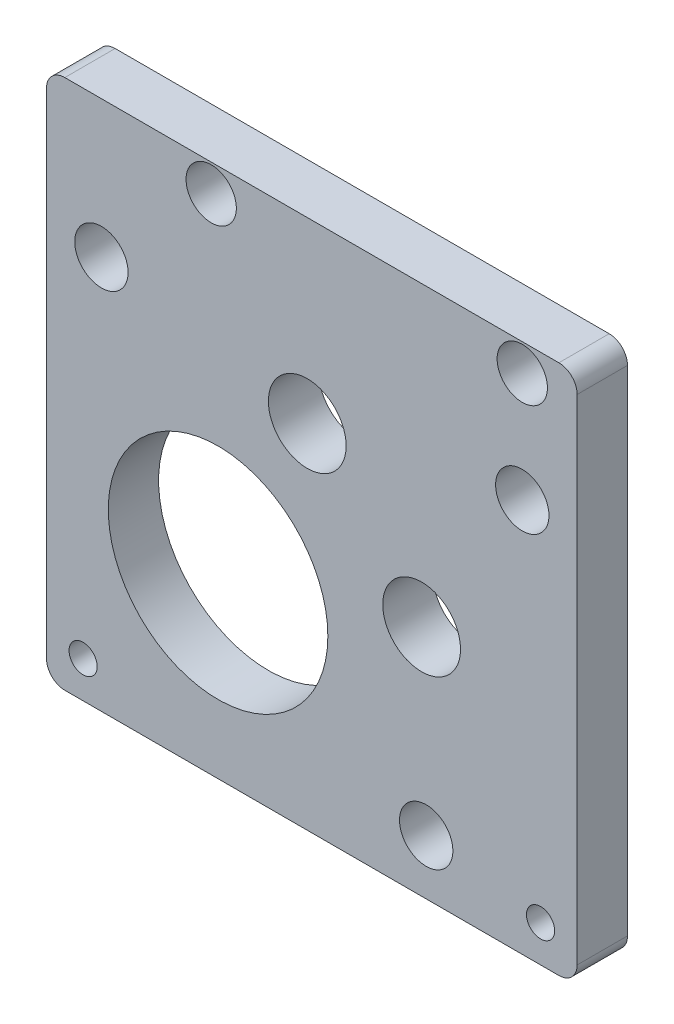
ISO-10303-21;
HEADER;
FILE_DESCRIPTION(('STEP AP214'),'2;1');
FILE_NAME('part.step','',(''),(''),'','','');
FILE_SCHEMA(('AUTOMOTIVE_DESIGN { 1 0 10303 214 1 1 1 1 }'));
ENDSEC;
DATA;
#1=APPLICATION_CONTEXT('core data for automotive mechanical design processes');
#2=APPLICATION_PROTOCOL_DEFINITION('international standard','automotive_design',2000,#1);
#3=PRODUCT_CONTEXT('',#1,'mechanical');
#4=PRODUCT('Part','Part','',(#3));
#5=PRODUCT_RELATED_PRODUCT_CATEGORY('part','',(#4));
#6=PRODUCT_DEFINITION_FORMATION('','',#4);
#7=PRODUCT_DEFINITION_CONTEXT('part definition',#1,'design');
#8=PRODUCT_DEFINITION('design','',#6,#7);
#9=PRODUCT_DEFINITION_SHAPE('','',#8);
#10=(LENGTH_UNIT() NAMED_UNIT(*) SI_UNIT(.MILLI.,.METRE.));
#11=(NAMED_UNIT(*) PLANE_ANGLE_UNIT() SI_UNIT($,.RADIAN.));
#12=(NAMED_UNIT(*) SI_UNIT($,.STERADIAN.) SOLID_ANGLE_UNIT());
#13=UNCERTAINTY_MEASURE_WITH_UNIT(LENGTH_MEASURE(1.E-05),#10,'distance_accuracy_value','');
#14=(GEOMETRIC_REPRESENTATION_CONTEXT(3) GLOBAL_UNCERTAINTY_ASSIGNED_CONTEXT((#13)) GLOBAL_UNIT_ASSIGNED_CONTEXT((#10,
#11,#12)) REPRESENTATION_CONTEXT('',''));
#15=CARTESIAN_POINT('',(0.,0.,0.));
#16=DIRECTION('',(0.,0.,1.));
#17=DIRECTION('',(1.,0.,0.));
#18=AXIS2_PLACEMENT_3D('',#15,#16,#17);
#19=CARTESIAN_POINT('',(29.,0.,5.5));
#20=DIRECTION('',(-1.,0.,0.));
#21=DIRECTION('',(0.,0.,1.));
#22=AXIS2_PLACEMENT_3D('',#19,#20,#21);
#23=PLANE('',#22);
#24=DIRECTION('',(0.,1.,0.));
#25=VECTOR('',#24,1.);
#26=CARTESIAN_POINT('',(29.,0.,0.));
#27=LINE('',#26,#25);
#28=CARTESIAN_POINT('',(29.,-27.,0.));
#29=VERTEX_POINT('',#28);
#30=CARTESIAN_POINT('',(29.,27.,0.));
#31=VERTEX_POINT('',#30);
#32=EDGE_CURVE('E162',#29,#31,#27,.T.);
#33=ORIENTED_EDGE('',*,*,#32,.T.);
#34=DIRECTION('',(0.,0.,-1.));
#35=VECTOR('',#34,1.);
#36=CARTESIAN_POINT('',(29.,27.,5.5));
#37=LINE('',#36,#35);
#38=CARTESIAN_POINT('',(29.,27.,5.5));
#39=VERTEX_POINT('',#38);
#40=EDGE_CURVE('E11',#39,#31,#37,.T.);
#41=ORIENTED_EDGE('',*,*,#40,.F.);
#42=DIRECTION('',(0.,1.,0.));
#43=VECTOR('',#42,1.);
#44=CARTESIAN_POINT('',(29.,0.,5.5));
#45=LINE('',#44,#43);
#46=CARTESIAN_POINT('',(29.,-27.,5.5));
#47=VERTEX_POINT('',#46);
#48=EDGE_CURVE('E208',#47,#39,#45,.T.);
#49=ORIENTED_EDGE('',*,*,#48,.F.);
#50=DIRECTION('',(0.,0.,-1.));
#51=VECTOR('',#50,1.);
#52=CARTESIAN_POINT('',(29.,-27.,5.5));
#53=LINE('',#52,#51);
#54=EDGE_CURVE('E128',#47,#29,#53,.T.);
#55=ORIENTED_EDGE('',*,*,#54,.T.);
#56=EDGE_LOOP('',(#33,#41,#49,#55));
#57=FACE_BOUND('',#56,.T.);
#58=ADVANCED_FACE('F35',(#57),#23,.F.);
#59=CARTESIAN_POINT('',(27.,27.,5.5));
#60=DIRECTION('',(0.,0.,-1.));
#61=DIRECTION('',(-1.,0.,0.));
#62=AXIS2_PLACEMENT_3D('',#59,#60,#61);
#63=CYLINDRICAL_SURFACE('',#62,2.);
#64=CARTESIAN_POINT('',(27.,27.,0.));
#65=DIRECTION('',(0.,0.,1.));
#66=DIRECTION('',(1.,0.,0.));
#67=AXIS2_PLACEMENT_3D('',#64,#65,#66);
#68=CIRCLE('',#67,2.);
#69=CARTESIAN_POINT('',(27.,29.,0.));
#70=VERTEX_POINT('',#69);
#71=EDGE_CURVE('E165',#31,#70,#68,.T.);
#72=ORIENTED_EDGE('',*,*,#71,.T.);
#73=DIRECTION('',(0.,0.,-1.));
#74=VECTOR('',#73,1.);
#75=CARTESIAN_POINT('',(27.,29.,5.5));
#76=LINE('',#75,#74);
#77=CARTESIAN_POINT('',(27.,29.,5.5));
#78=VERTEX_POINT('',#77);
#79=EDGE_CURVE('E44',#78,#70,#76,.T.);
#80=ORIENTED_EDGE('',*,*,#79,.F.);
#81=CARTESIAN_POINT('',(27.,27.,5.5));
#82=DIRECTION('',(0.,0.,1.));
#83=DIRECTION('',(1.,0.,0.));
#84=AXIS2_PLACEMENT_3D('',#81,#82,#83);
#85=CIRCLE('',#84,2.);
#86=EDGE_CURVE('E95',#39,#78,#85,.T.);
#87=ORIENTED_EDGE('',*,*,#86,.F.);
#88=ORIENTED_EDGE('',*,*,#40,.T.);
#89=EDGE_LOOP('',(#72,#80,#87,#88));
#90=FACE_BOUND('',#89,.T.);
#91=ADVANCED_FACE('F279',(#90),#63,.T.);
#92=CARTESIAN_POINT('',(0.,29.,5.5));
#93=DIRECTION('',(0.,-1.,0.));
#94=DIRECTION('',(0.,0.,-1.));
#95=AXIS2_PLACEMENT_3D('',#92,#93,#94);
#96=PLANE('',#95);
#97=DIRECTION('',(-1.,0.,0.));
#98=VECTOR('',#97,1.);
#99=CARTESIAN_POINT('',(0.,29.,0.));
#100=LINE('',#99,#98);
#101=CARTESIAN_POINT('',(-27.,29.,0.));
#102=VERTEX_POINT('',#101);
#103=EDGE_CURVE('E167',#70,#102,#100,.T.);
#104=ORIENTED_EDGE('',*,*,#103,.T.);
#105=DIRECTION('',(0.,0.,-1.));
#106=VECTOR('',#105,1.);
#107=CARTESIAN_POINT('',(-27.,29.,5.5));
#108=LINE('',#107,#106);
#109=CARTESIAN_POINT('',(-27.,29.,5.5));
#110=VERTEX_POINT('',#109);
#111=EDGE_CURVE('E183',#110,#102,#108,.T.);
#112=ORIENTED_EDGE('',*,*,#111,.F.);
#113=DIRECTION('',(-1.,0.,0.));
#114=VECTOR('',#113,1.);
#115=CARTESIAN_POINT('',(0.,29.,5.5));
#116=LINE('',#115,#114);
#117=EDGE_CURVE('E191',#78,#110,#116,.T.);
#118=ORIENTED_EDGE('',*,*,#117,.F.);
#119=ORIENTED_EDGE('',*,*,#79,.T.);
#120=EDGE_LOOP('',(#104,#112,#118,#119));
#121=FACE_BOUND('',#120,.T.);
#122=ADVANCED_FACE('F189',(#121),#96,.F.);
#123=CARTESIAN_POINT('',(-27.,27.,5.5));
#124=DIRECTION('',(0.,0.,-1.));
#125=DIRECTION('',(-1.,0.,0.));
#126=AXIS2_PLACEMENT_3D('',#123,#124,#125);
#127=CYLINDRICAL_SURFACE('',#126,2.);
#128=CARTESIAN_POINT('',(-27.,27.,0.));
#129=DIRECTION('',(0.,0.,1.));
#130=DIRECTION('',(1.,0.,0.));
#131=AXIS2_PLACEMENT_3D('',#128,#129,#130);
#132=CIRCLE('',#131,2.);
#133=CARTESIAN_POINT('',(-29.,27.,0.));
#134=VERTEX_POINT('',#133);
#135=EDGE_CURVE('E169',#102,#134,#132,.T.);
#136=ORIENTED_EDGE('',*,*,#135,.T.);
#137=DIRECTION('',(0.,0.,-1.));
#138=VECTOR('',#137,1.);
#139=CARTESIAN_POINT('',(-29.,27.,5.5));
#140=LINE('',#139,#138);
#141=CARTESIAN_POINT('',(-29.,27.,5.5));
#142=VERTEX_POINT('',#141);
#143=EDGE_CURVE('E180',#142,#134,#140,.T.);
#144=ORIENTED_EDGE('',*,*,#143,.F.);
#145=CARTESIAN_POINT('',(-27.,27.,5.5));
#146=DIRECTION('',(0.,0.,1.));
#147=DIRECTION('',(1.,0.,0.));
#148=AXIS2_PLACEMENT_3D('',#145,#146,#147);
#149=CIRCLE('',#148,2.);
#150=EDGE_CURVE('E203',#110,#142,#149,.T.);
#151=ORIENTED_EDGE('',*,*,#150,.F.);
#152=ORIENTED_EDGE('',*,*,#111,.T.);
#153=EDGE_LOOP('',(#136,#144,#151,#152));
#154=FACE_BOUND('',#153,.T.);
#155=ADVANCED_FACE('F199',(#154),#127,.T.);
#156=CARTESIAN_POINT('',(-29.,0.,5.5));
#157=DIRECTION('',(1.,0.,0.));
#158=DIRECTION('',(0.,0.,-1.));
#159=AXIS2_PLACEMENT_3D('',#156,#157,#158);
#160=PLANE('',#159);
#161=DIRECTION('',(0.,-1.,0.));
#162=VECTOR('',#161,1.);
#163=CARTESIAN_POINT('',(-29.,0.,0.));
#164=LINE('',#163,#162);
#165=CARTESIAN_POINT('',(-29.,-27.,0.));
#166=VERTEX_POINT('',#165);
#167=EDGE_CURVE('E171',#134,#166,#164,.T.);
#168=ORIENTED_EDGE('',*,*,#167,.T.);
#169=DIRECTION('',(0.,0.,-1.));
#170=VECTOR('',#169,1.);
#171=CARTESIAN_POINT('',(-29.,-27.,5.5));
#172=LINE('',#171,#170);
#173=CARTESIAN_POINT('',(-29.,-27.,5.5));
#174=VERTEX_POINT('',#173);
#175=EDGE_CURVE('E123',#174,#166,#172,.T.);
#176=ORIENTED_EDGE('',*,*,#175,.F.);
#177=DIRECTION('',(0.,-1.,0.));
#178=VECTOR('',#177,1.);
#179=CARTESIAN_POINT('',(-29.,0.,5.5));
#180=LINE('',#179,#178);
#181=EDGE_CURVE('E114',#142,#174,#180,.T.);
#182=ORIENTED_EDGE('',*,*,#181,.F.);
#183=ORIENTED_EDGE('',*,*,#143,.T.);
#184=EDGE_LOOP('',(#168,#176,#182,#183));
#185=FACE_BOUND('',#184,.T.);
#186=ADVANCED_FACE('F202',(#185),#160,.F.);
#187=CARTESIAN_POINT('',(-27.,-27.,5.5));
#188=DIRECTION('',(0.,0.,-1.));
#189=DIRECTION('',(-1.,0.,0.));
#190=AXIS2_PLACEMENT_3D('',#187,#188,#189);
#191=CYLINDRICAL_SURFACE('',#190,2.);
#192=CARTESIAN_POINT('',(-27.,-27.,0.));
#193=DIRECTION('',(0.,0.,1.));
#194=DIRECTION('',(1.,0.,0.));
#195=AXIS2_PLACEMENT_3D('',#192,#193,#194);
#196=CIRCLE('',#195,2.);
#197=CARTESIAN_POINT('',(-27.,-29.,0.));
#198=VERTEX_POINT('',#197);
#199=EDGE_CURVE('E122',#166,#198,#196,.T.);
#200=ORIENTED_EDGE('',*,*,#199,.T.);
#201=DIRECTION('',(0.,0.,-1.));
#202=VECTOR('',#201,1.);
#203=CARTESIAN_POINT('',(-27.,-29.,5.5));
#204=LINE('',#203,#202);
#205=CARTESIAN_POINT('',(-27.,-29.,5.5));
#206=VERTEX_POINT('',#205);
#207=EDGE_CURVE('E119',#206,#198,#204,.T.);
#208=ORIENTED_EDGE('',*,*,#207,.F.);
#209=CARTESIAN_POINT('',(-27.,-27.,5.5));
#210=DIRECTION('',(0.,0.,1.));
#211=DIRECTION('',(1.,0.,0.));
#212=AXIS2_PLACEMENT_3D('',#209,#210,#211);
#213=CIRCLE('',#212,2.);
#214=EDGE_CURVE('E108',#174,#206,#213,.T.);
#215=ORIENTED_EDGE('',*,*,#214,.F.);
#216=ORIENTED_EDGE('',*,*,#175,.T.);
#217=EDGE_LOOP('',(#200,#208,#215,#216));
#218=FACE_BOUND('',#217,.T.);
#219=ADVANCED_FACE('F120',(#218),#191,.T.);
#220=CARTESIAN_POINT('',(0.,-29.,5.5));
#221=DIRECTION('',(0.,1.,0.));
#222=DIRECTION('',(0.,0.,1.));
#223=AXIS2_PLACEMENT_3D('',#220,#221,#222);
#224=PLANE('',#223);
#225=DIRECTION('',(1.,0.,0.));
#226=VECTOR('',#225,1.);
#227=CARTESIAN_POINT('',(0.,-29.,0.));
#228=LINE('',#227,#226);
#229=CARTESIAN_POINT('',(27.,-29.,0.));
#230=VERTEX_POINT('',#229);
#231=EDGE_CURVE('E81',#198,#230,#228,.T.);
#232=ORIENTED_EDGE('',*,*,#231,.T.);
#233=DIRECTION('',(0.,0.,-1.));
#234=VECTOR('',#233,1.);
#235=CARTESIAN_POINT('',(27.,-29.,5.5));
#236=LINE('',#235,#234);
#237=CARTESIAN_POINT('',(27.,-29.,5.5));
#238=VERTEX_POINT('',#237);
#239=EDGE_CURVE('E124',#238,#230,#236,.T.);
#240=ORIENTED_EDGE('',*,*,#239,.F.);
#241=DIRECTION('',(1.,0.,0.));
#242=VECTOR('',#241,1.);
#243=CARTESIAN_POINT('',(0.,-29.,5.5));
#244=LINE('',#243,#242);
#245=EDGE_CURVE('E112',#206,#238,#244,.T.);
#246=ORIENTED_EDGE('',*,*,#245,.F.);
#247=ORIENTED_EDGE('',*,*,#207,.T.);
#248=EDGE_LOOP('',(#232,#240,#246,#247));
#249=FACE_BOUND('',#248,.T.);
#250=ADVANCED_FACE('F126',(#249),#224,.F.);
#251=CARTESIAN_POINT('',(12.,-3.5,5.5));
#252=DIRECTION('',(0.,0.,-1.));
#253=DIRECTION('',(-1.,0.,0.));
#254=AXIS2_PLACEMENT_3D('',#251,#252,#253);
#255=CYLINDRICAL_SURFACE('',#254,4.25000000000001);
#256=CARTESIAN_POINT('',(12.,-3.5,5.5));
#257=DIRECTION('',(0.,0.,1.));
#258=DIRECTION('',(1.,0.,0.));
#259=AXIS2_PLACEMENT_3D('',#256,#257,#258);
#260=CIRCLE('',#259,4.25000000000001);
#261=CARTESIAN_POINT('',(16.25,-3.5,5.5));
#262=VERTEX_POINT('',#261);
#263=EDGE_CURVE('E210',#262,#262,#260,.T.);
#264=ORIENTED_EDGE('',*,*,#263,.T.);
#265=EDGE_LOOP('',(#264));
#266=FACE_BOUND('',#265,.T.);
#267=CARTESIAN_POINT('',(12.,-3.5,0.));
#268=DIRECTION('',(0.,0.,1.));
#269=DIRECTION('',(1.,0.,0.));
#270=AXIS2_PLACEMENT_3D('',#267,#268,#269);
#271=CIRCLE('',#270,4.25000000000001);
#272=CARTESIAN_POINT('',(16.25,-3.5,0.));
#273=VERTEX_POINT('',#272);
#274=EDGE_CURVE('E159',#273,#273,#271,.T.);
#275=ORIENTED_EDGE('',*,*,#274,.F.);
#276=EDGE_LOOP('',(#275));
#277=FACE_BOUND('',#276,.T.);
#278=ADVANCED_FACE('F264',(#266,#277),#255,.F.);
#279=CARTESIAN_POINT('',(-25.,-25.,5.5));
#280=DIRECTION('',(0.,0.,-1.));
#281=DIRECTION('',(-1.,0.,0.));
#282=AXIS2_PLACEMENT_3D('',#279,#280,#281);
#283=CYLINDRICAL_SURFACE('',#282,1.53775);
#284=CARTESIAN_POINT('',(-25.,-25.,5.5));
#285=DIRECTION('',(0.,0.,1.));
#286=DIRECTION('',(1.,0.,0.));
#287=AXIS2_PLACEMENT_3D('',#284,#285,#286);
#288=CIRCLE('',#287,1.53775);
#289=CARTESIAN_POINT('',(-23.46225,-25.,5.5));
#290=VERTEX_POINT('',#289);
#291=EDGE_CURVE('E213',#290,#290,#288,.T.);
#292=ORIENTED_EDGE('',*,*,#291,.T.);
#293=EDGE_LOOP('',(#292));
#294=FACE_BOUND('',#293,.T.);
#295=CARTESIAN_POINT('',(-25.,-25.,0.));
#296=DIRECTION('',(0.,0.,1.));
#297=DIRECTION('',(1.,0.,0.));
#298=AXIS2_PLACEMENT_3D('',#295,#296,#297);
#299=CIRCLE('',#298,1.53775);
#300=CARTESIAN_POINT('',(-23.46225,-25.,0.));
#301=VERTEX_POINT('',#300);
#302=EDGE_CURVE('E156',#301,#301,#299,.T.);
#303=ORIENTED_EDGE('',*,*,#302,.F.);
#304=EDGE_LOOP('',(#303));
#305=FACE_BOUND('',#304,.T.);
#306=ADVANCED_FACE('F267',(#294,#305),#283,.F.);
#307=CARTESIAN_POINT('',(-23.,14.,5.5));
#308=DIRECTION('',(0.,0.,-1.));
#309=DIRECTION('',(-1.,0.,0.));
#310=AXIS2_PLACEMENT_3D('',#307,#308,#309);
#311=CYLINDRICAL_SURFACE('',#310,2.916);
#312=CARTESIAN_POINT('',(-23.,14.,5.5));
#313=DIRECTION('',(0.,0.,1.));
#314=DIRECTION('',(1.,0.,0.));
#315=AXIS2_PLACEMENT_3D('',#312,#313,#314);
#316=CIRCLE('',#315,2.916);
#317=CARTESIAN_POINT('',(-20.084,14.,5.5));
#318=VERTEX_POINT('',#317);
#319=EDGE_CURVE('E216',#318,#318,#316,.T.);
#320=ORIENTED_EDGE('',*,*,#319,.T.);
#321=EDGE_LOOP('',(#320));
#322=FACE_BOUND('',#321,.T.);
#323=CARTESIAN_POINT('',(-23.,14.,0.));
#324=DIRECTION('',(0.,0.,1.));
#325=DIRECTION('',(1.,0.,0.));
#326=AXIS2_PLACEMENT_3D('',#323,#324,#325);
#327=CIRCLE('',#326,2.916);
#328=CARTESIAN_POINT('',(-20.084,14.,0.));
#329=VERTEX_POINT('',#328);
#330=EDGE_CURVE('E153',#329,#329,#327,.T.);
#331=ORIENTED_EDGE('',*,*,#330,.F.);
#332=EDGE_LOOP('',(#331));
#333=FACE_BOUND('',#332,.T.);
#334=ADVANCED_FACE('F290',(#322,#333),#311,.F.);
#335=CARTESIAN_POINT('',(23.,14.,5.5));
#336=DIRECTION('',(0.,0.,-1.));
#337=DIRECTION('',(-1.,0.,0.));
#338=AXIS2_PLACEMENT_3D('',#335,#336,#337);
#339=CYLINDRICAL_SURFACE('',#338,2.91600000000001);
#340=CARTESIAN_POINT('',(23.,14.,5.5));
#341=DIRECTION('',(0.,0.,1.));
#342=DIRECTION('',(1.,0.,0.));
#343=AXIS2_PLACEMENT_3D('',#340,#341,#342);
#344=CIRCLE('',#343,2.91600000000001);
#345=CARTESIAN_POINT('',(25.916,14.,5.5));
#346=VERTEX_POINT('',#345);
#347=EDGE_CURVE('E219',#346,#346,#344,.T.);
#348=ORIENTED_EDGE('',*,*,#347,.T.);
#349=EDGE_LOOP('',(#348));
#350=FACE_BOUND('',#349,.T.);
#351=CARTESIAN_POINT('',(23.,14.,0.));
#352=DIRECTION('',(0.,0.,1.));
#353=DIRECTION('',(1.,0.,0.));
#354=AXIS2_PLACEMENT_3D('',#351,#352,#353);
#355=CIRCLE('',#354,2.91600000000001);
#356=CARTESIAN_POINT('',(25.916,14.,0.));
#357=VERTEX_POINT('',#356);
#358=EDGE_CURVE('E150',#357,#357,#355,.T.);
#359=ORIENTED_EDGE('',*,*,#358,.F.);
#360=EDGE_LOOP('',(#359));
#361=FACE_BOUND('',#360,.T.);
#362=ADVANCED_FACE('F294',(#350,#361),#339,.F.);
#363=CARTESIAN_POINT('',(23.,26.,5.5));
#364=DIRECTION('',(0.,0.,-1.));
#365=DIRECTION('',(-1.,0.,0.));
#366=AXIS2_PLACEMENT_3D('',#363,#364,#365);
#367=CYLINDRICAL_SURFACE('',#366,2.75000000000001);
#368=CARTESIAN_POINT('',(23.,26.,5.5));
#369=DIRECTION('',(0.,0.,1.));
#370=DIRECTION('',(1.,0.,0.));
#371=AXIS2_PLACEMENT_3D('',#368,#369,#370);
#372=CIRCLE('',#371,2.75000000000001);
#373=CARTESIAN_POINT('',(25.75,26.,5.5));
#374=VERTEX_POINT('',#373);
#375=EDGE_CURVE('E222',#374,#374,#372,.T.);
#376=ORIENTED_EDGE('',*,*,#375,.T.);
#377=EDGE_LOOP('',(#376));
#378=FACE_BOUND('',#377,.T.);
#379=CARTESIAN_POINT('',(23.,26.,0.));
#380=DIRECTION('',(0.,0.,1.));
#381=DIRECTION('',(1.,0.,0.));
#382=AXIS2_PLACEMENT_3D('',#379,#380,#381);
#383=CIRCLE('',#382,2.75000000000001);
#384=CARTESIAN_POINT('',(25.75,26.,0.));
#385=VERTEX_POINT('',#384);
#386=EDGE_CURVE('E147',#385,#385,#383,.T.);
#387=ORIENTED_EDGE('',*,*,#386,.F.);
#388=EDGE_LOOP('',(#387));
#389=FACE_BOUND('',#388,.T.);
#390=ADVANCED_FACE('F298',(#378,#389),#367,.F.);
#391=CARTESIAN_POINT('',(-10.25,-9.5,5.5));
#392=DIRECTION('',(0.,0.,-1.));
#393=DIRECTION('',(-1.,0.,0.));
#394=AXIS2_PLACEMENT_3D('',#391,#392,#393);
#395=CYLINDRICAL_SURFACE('',#394,12.);
#396=CARTESIAN_POINT('',(-10.25,-9.5,5.5));
#397=DIRECTION('',(0.,0.,1.));
#398=DIRECTION('',(1.,0.,0.));
#399=AXIS2_PLACEMENT_3D('',#396,#397,#398);
#400=CIRCLE('',#399,12.);
#401=CARTESIAN_POINT('',(1.75000000000001,-9.5,5.5));
#402=VERTEX_POINT('',#401);
#403=EDGE_CURVE('E225',#402,#402,#400,.T.);
#404=ORIENTED_EDGE('',*,*,#403,.T.);
#405=EDGE_LOOP('',(#404));
#406=FACE_BOUND('',#405,.T.);
#407=CARTESIAN_POINT('',(-10.25,-9.5,0.));
#408=DIRECTION('',(0.,0.,1.));
#409=DIRECTION('',(1.,0.,0.));
#410=AXIS2_PLACEMENT_3D('',#407,#408,#409);
#411=CIRCLE('',#410,12.);
#412=CARTESIAN_POINT('',(1.75000000000001,-9.5,0.));
#413=VERTEX_POINT('',#412);
#414=EDGE_CURVE('E144',#413,#413,#411,.T.);
#415=ORIENTED_EDGE('',*,*,#414,.F.);
#416=EDGE_LOOP('',(#415));
#417=FACE_BOUND('',#416,.T.);
#418=ADVANCED_FACE('F302',(#406,#417),#395,.F.);
#419=CARTESIAN_POINT('',(-11.,26.,5.5));
#420=DIRECTION('',(0.,0.,-1.));
#421=DIRECTION('',(-1.,0.,0.));
#422=AXIS2_PLACEMENT_3D('',#419,#420,#421);
#423=CYLINDRICAL_SURFACE('',#422,2.75);
#424=CARTESIAN_POINT('',(-11.,26.,5.5));
#425=DIRECTION('',(0.,0.,1.));
#426=DIRECTION('',(1.,0.,0.));
#427=AXIS2_PLACEMENT_3D('',#424,#425,#426);
#428=CIRCLE('',#427,2.75);
#429=CARTESIAN_POINT('',(-8.25,26.,5.5));
#430=VERTEX_POINT('',#429);
#431=EDGE_CURVE('E228',#430,#430,#428,.T.);
#432=ORIENTED_EDGE('',*,*,#431,.T.);
#433=EDGE_LOOP('',(#432));
#434=FACE_BOUND('',#433,.T.);
#435=CARTESIAN_POINT('',(-11.,26.,0.));
#436=DIRECTION('',(0.,0.,1.));
#437=DIRECTION('',(1.,0.,0.));
#438=AXIS2_PLACEMENT_3D('',#435,#436,#437);
#439=CIRCLE('',#438,2.75);
#440=CARTESIAN_POINT('',(-8.25,26.,0.));
#441=VERTEX_POINT('',#440);
#442=EDGE_CURVE('E141',#441,#441,#439,.T.);
#443=ORIENTED_EDGE('',*,*,#442,.F.);
#444=EDGE_LOOP('',(#443));
#445=FACE_BOUND('',#444,.T.);
#446=ADVANCED_FACE('F306',(#434,#445),#423,.F.);
#447=CARTESIAN_POINT('',(12.5,-23.,5.5));
#448=DIRECTION('',(0.,0.,-1.));
#449=DIRECTION('',(-1.,0.,0.));
#450=AXIS2_PLACEMENT_3D('',#447,#448,#449);
#451=CYLINDRICAL_SURFACE('',#450,2.91600000000001);
#452=CARTESIAN_POINT('',(12.5,-23.,5.5));
#453=DIRECTION('',(0.,0.,1.));
#454=DIRECTION('',(1.,0.,0.));
#455=AXIS2_PLACEMENT_3D('',#452,#453,#454);
#456=CIRCLE('',#455,2.91600000000001);
#457=CARTESIAN_POINT('',(15.416,-23.,5.5));
#458=VERTEX_POINT('',#457);
#459=EDGE_CURVE('E231',#458,#458,#456,.T.);
#460=ORIENTED_EDGE('',*,*,#459,.T.);
#461=EDGE_LOOP('',(#460));
#462=FACE_BOUND('',#461,.T.);
#463=CARTESIAN_POINT('',(12.5,-23.,0.));
#464=DIRECTION('',(0.,0.,1.));
#465=DIRECTION('',(1.,0.,0.));
#466=AXIS2_PLACEMENT_3D('',#463,#464,#465);
#467=CIRCLE('',#466,2.91600000000001);
#468=CARTESIAN_POINT('',(15.416,-23.,0.));
#469=VERTEX_POINT('',#468);
#470=EDGE_CURVE('E138',#469,#469,#467,.T.);
#471=ORIENTED_EDGE('',*,*,#470,.F.);
#472=EDGE_LOOP('',(#471));
#473=FACE_BOUND('',#472,.T.);
#474=ADVANCED_FACE('F310',(#462,#473),#451,.F.);
#475=CARTESIAN_POINT('',(25.,-25.,5.5));
#476=DIRECTION('',(0.,0.,-1.));
#477=DIRECTION('',(-1.,0.,0.));
#478=AXIS2_PLACEMENT_3D('',#475,#476,#477);
#479=CYLINDRICAL_SURFACE('',#478,1.53775);
#480=CARTESIAN_POINT('',(25.,-25.,5.5));
#481=DIRECTION('',(0.,0.,1.));
#482=DIRECTION('',(1.,0.,0.));
#483=AXIS2_PLACEMENT_3D('',#480,#481,#482);
#484=CIRCLE('',#483,1.53775);
#485=CARTESIAN_POINT('',(26.53775,-25.,5.5));
#486=VERTEX_POINT('',#485);
#487=EDGE_CURVE('E234',#486,#486,#484,.T.);
#488=ORIENTED_EDGE('',*,*,#487,.T.);
#489=EDGE_LOOP('',(#488));
#490=FACE_BOUND('',#489,.T.);
#491=CARTESIAN_POINT('',(25.,-25.,0.));
#492=DIRECTION('',(0.,0.,1.));
#493=DIRECTION('',(1.,0.,0.));
#494=AXIS2_PLACEMENT_3D('',#491,#492,#493);
#495=CIRCLE('',#494,1.53775);
#496=CARTESIAN_POINT('',(26.53775,-25.,0.));
#497=VERTEX_POINT('',#496);
#498=EDGE_CURVE('E135',#497,#497,#495,.T.);
#499=ORIENTED_EDGE('',*,*,#498,.F.);
#500=EDGE_LOOP('',(#499));
#501=FACE_BOUND('',#500,.T.);
#502=ADVANCED_FACE('F313',(#490,#501),#479,.F.);
#503=CARTESIAN_POINT('',(-0.5,9.5,5.5));
#504=DIRECTION('',(0.,0.,-1.));
#505=DIRECTION('',(-1.,0.,0.));
#506=AXIS2_PLACEMENT_3D('',#503,#504,#505);
#507=CYLINDRICAL_SURFACE('',#506,4.25000000000001);
#508=CARTESIAN_POINT('',(-0.5,9.5,5.5));
#509=DIRECTION('',(0.,0.,1.));
#510=DIRECTION('',(1.,0.,0.));
#511=AXIS2_PLACEMENT_3D('',#508,#509,#510);
#512=CIRCLE('',#511,4.25000000000001);
#513=CARTESIAN_POINT('',(3.75,9.5,5.5));
#514=VERTEX_POINT('',#513);
#515=EDGE_CURVE('E176',#514,#514,#512,.T.);
#516=ORIENTED_EDGE('',*,*,#515,.T.);
#517=EDGE_LOOP('',(#516));
#518=FACE_BOUND('',#517,.T.);
#519=CARTESIAN_POINT('',(-0.5,9.5,0.));
#520=DIRECTION('',(0.,0.,1.));
#521=DIRECTION('',(1.,0.,0.));
#522=AXIS2_PLACEMENT_3D('',#519,#520,#521);
#523=CIRCLE('',#522,4.25000000000001);
#524=CARTESIAN_POINT('',(3.75,9.5,0.));
#525=VERTEX_POINT('',#524);
#526=EDGE_CURVE('E132',#525,#525,#523,.T.);
#527=ORIENTED_EDGE('',*,*,#526,.F.);
#528=EDGE_LOOP('',(#527));
#529=FACE_BOUND('',#528,.T.);
#530=ADVANCED_FACE('F37',(#518,#529),#507,.F.);
#531=CARTESIAN_POINT('',(27.,-27.,5.5));
#532=DIRECTION('',(0.,0.,-1.));
#533=DIRECTION('',(-1.,0.,0.));
#534=AXIS2_PLACEMENT_3D('',#531,#532,#533);
#535=CYLINDRICAL_SURFACE('',#534,2.);
#536=CARTESIAN_POINT('',(27.,-27.,0.));
#537=DIRECTION('',(0.,0.,1.));
#538=DIRECTION('',(1.,0.,0.));
#539=AXIS2_PLACEMENT_3D('',#536,#537,#538);
#540=CIRCLE('',#539,2.);
#541=EDGE_CURVE('E87',#230,#29,#540,.T.);
#542=ORIENTED_EDGE('',*,*,#541,.T.);
#543=ORIENTED_EDGE('',*,*,#54,.F.);
#544=CARTESIAN_POINT('',(27.,-27.,5.5));
#545=DIRECTION('',(0.,0.,1.));
#546=DIRECTION('',(1.,0.,0.));
#547=AXIS2_PLACEMENT_3D('',#544,#545,#546);
#548=CIRCLE('',#547,2.);
#549=EDGE_CURVE('E52',#238,#47,#548,.T.);
#550=ORIENTED_EDGE('',*,*,#549,.F.);
#551=ORIENTED_EDGE('',*,*,#239,.T.);
#552=EDGE_LOOP('',(#542,#543,#550,#551));
#553=FACE_BOUND('',#552,.T.);
#554=ADVANCED_FACE('F244',(#553),#535,.T.);
#555=CARTESIAN_POINT('',(0.,0.,5.5));
#556=DIRECTION('',(0.,0.,1.));
#557=DIRECTION('',(1.,0.,0.));
#558=AXIS2_PLACEMENT_3D('',#555,#556,#557);
#559=PLANE('',#558);
#560=ORIENTED_EDGE('',*,*,#515,.F.);
#561=EDGE_LOOP('',(#560));
#562=FACE_BOUND('',#561,.T.);
#563=ORIENTED_EDGE('',*,*,#487,.F.);
#564=EDGE_LOOP('',(#563));
#565=FACE_BOUND('',#564,.T.);
#566=ORIENTED_EDGE('',*,*,#459,.F.);
#567=EDGE_LOOP('',(#566));
#568=FACE_BOUND('',#567,.T.);
#569=ORIENTED_EDGE('',*,*,#431,.F.);
#570=EDGE_LOOP('',(#569));
#571=FACE_BOUND('',#570,.T.);
#572=ORIENTED_EDGE('',*,*,#403,.F.);
#573=EDGE_LOOP('',(#572));
#574=FACE_BOUND('',#573,.T.);
#575=ORIENTED_EDGE('',*,*,#375,.F.);
#576=EDGE_LOOP('',(#575));
#577=FACE_BOUND('',#576,.T.);
#578=ORIENTED_EDGE('',*,*,#347,.F.);
#579=EDGE_LOOP('',(#578));
#580=FACE_BOUND('',#579,.T.);
#581=ORIENTED_EDGE('',*,*,#319,.F.);
#582=EDGE_LOOP('',(#581));
#583=FACE_BOUND('',#582,.T.);
#584=ORIENTED_EDGE('',*,*,#291,.F.);
#585=EDGE_LOOP('',(#584));
#586=FACE_BOUND('',#585,.T.);
#587=ORIENTED_EDGE('',*,*,#263,.F.);
#588=EDGE_LOOP('',(#587));
#589=FACE_BOUND('',#588,.T.);
#590=ORIENTED_EDGE('',*,*,#48,.T.);
#591=ORIENTED_EDGE('',*,*,#86,.T.);
#592=ORIENTED_EDGE('',*,*,#117,.T.);
#593=ORIENTED_EDGE('',*,*,#150,.T.);
#594=ORIENTED_EDGE('',*,*,#181,.T.);
#595=ORIENTED_EDGE('',*,*,#214,.T.);
#596=ORIENTED_EDGE('',*,*,#245,.T.);
#597=ORIENTED_EDGE('',*,*,#549,.T.);
#598=EDGE_LOOP('',(#590,#591,#592,#593,#594,#595,#596,#597));
#599=FACE_BOUND('',#598,.T.);
#600=ADVANCED_FACE('F110',(#562,#565,#568,#571,#574,#577,#580,#583,#586,#589,#599),#559,.T.);
#601=CARTESIAN_POINT('',(0.,0.,0.));
#602=DIRECTION('',(0.,0.,1.));
#603=DIRECTION('',(1.,0.,0.));
#604=AXIS2_PLACEMENT_3D('',#601,#602,#603);
#605=PLANE('',#604);
#606=ORIENTED_EDGE('',*,*,#526,.T.);
#607=EDGE_LOOP('',(#606));
#608=FACE_BOUND('',#607,.T.);
#609=ORIENTED_EDGE('',*,*,#498,.T.);
#610=EDGE_LOOP('',(#609));
#611=FACE_BOUND('',#610,.T.);
#612=ORIENTED_EDGE('',*,*,#470,.T.);
#613=EDGE_LOOP('',(#612));
#614=FACE_BOUND('',#613,.T.);
#615=ORIENTED_EDGE('',*,*,#442,.T.);
#616=EDGE_LOOP('',(#615));
#617=FACE_BOUND('',#616,.T.);
#618=ORIENTED_EDGE('',*,*,#414,.T.);
#619=EDGE_LOOP('',(#618));
#620=FACE_BOUND('',#619,.T.);
#621=ORIENTED_EDGE('',*,*,#386,.T.);
#622=EDGE_LOOP('',(#621));
#623=FACE_BOUND('',#622,.T.);
#624=ORIENTED_EDGE('',*,*,#358,.T.);
#625=EDGE_LOOP('',(#624));
#626=FACE_BOUND('',#625,.T.);
#627=ORIENTED_EDGE('',*,*,#330,.T.);
#628=EDGE_LOOP('',(#627));
#629=FACE_BOUND('',#628,.T.);
#630=ORIENTED_EDGE('',*,*,#302,.T.);
#631=EDGE_LOOP('',(#630));
#632=FACE_BOUND('',#631,.T.);
#633=ORIENTED_EDGE('',*,*,#274,.T.);
#634=EDGE_LOOP('',(#633));
#635=FACE_BOUND('',#634,.T.);
#636=ORIENTED_EDGE('',*,*,#32,.F.);
#637=ORIENTED_EDGE('',*,*,#541,.F.);
#638=ORIENTED_EDGE('',*,*,#231,.F.);
#639=ORIENTED_EDGE('',*,*,#199,.F.);
#640=ORIENTED_EDGE('',*,*,#167,.F.);
#641=ORIENTED_EDGE('',*,*,#135,.F.);
#642=ORIENTED_EDGE('',*,*,#103,.F.);
#643=ORIENTED_EDGE('',*,*,#71,.F.);
#644=EDGE_LOOP('',(#636,#637,#638,#639,#640,#641,#642,#643));
#645=FACE_BOUND('',#644,.T.);
#646=ADVANCED_FACE('F195',(#608,#611,#614,#617,#620,#623,#626,#629,#632,#635,#645),#605,.F.);
#647=CLOSED_SHELL('',(#58,#91,#122,#155,#186,#219,#250,#278,#306,#334,#362,#390,#418,#446,#474,
#502,#530,#554,#600,#646));
#648=MANIFOLD_SOLID_BREP('B2',#647);
#649=ADVANCED_BREP_SHAPE_REPRESENTATION('',(#18,#648),#14);
#650=SHAPE_DEFINITION_REPRESENTATION(#9,#649);
ENDSEC;
END-ISO-10303-21;
